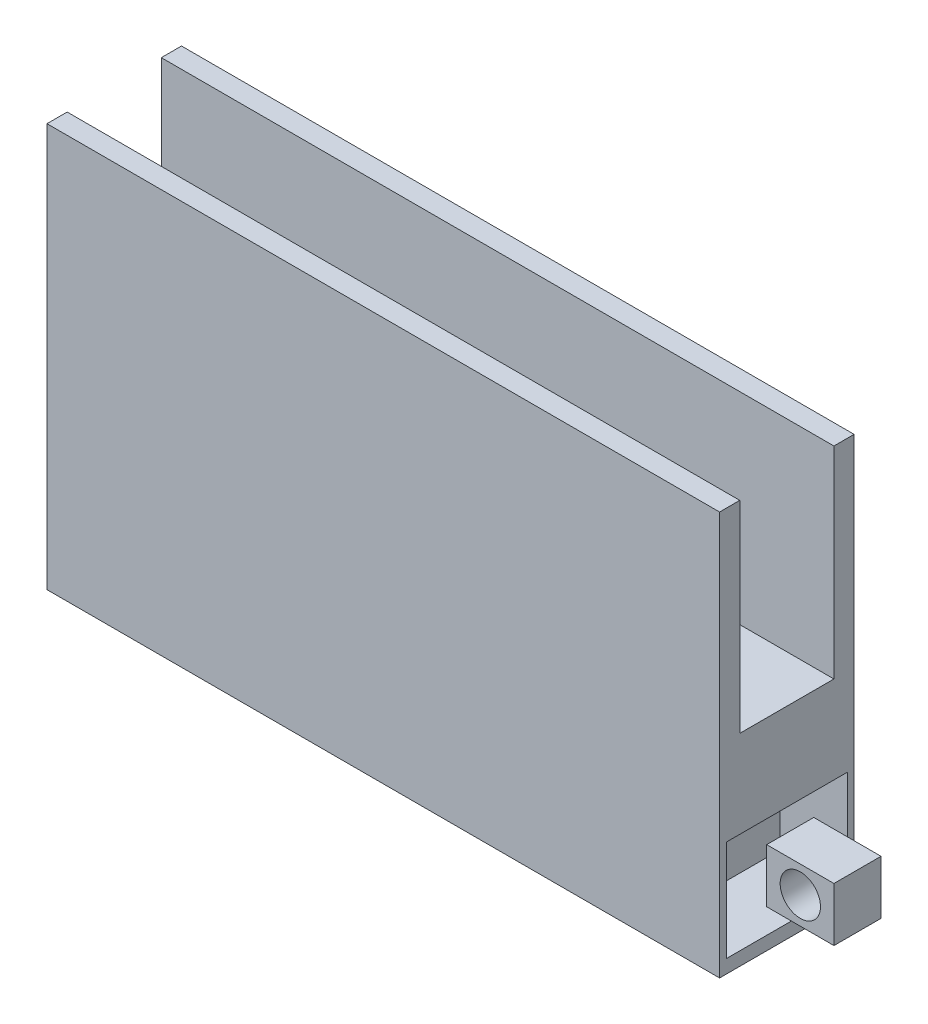
ISO-10303-21;
HEADER;
FILE_DESCRIPTION(('STEP AP214'),'2;1');
FILE_NAME('part.step','',(''),(''),'','','');
FILE_SCHEMA(('AUTOMOTIVE_DESIGN { 1 0 10303 214 1 1 1 1 }'));
ENDSEC;
DATA;
#1=APPLICATION_CONTEXT('core data for automotive mechanical design processes');
#2=APPLICATION_PROTOCOL_DEFINITION('international standard','automotive_design',2000,#1);
#3=PRODUCT_CONTEXT('',#1,'mechanical');
#4=PRODUCT('Part','Part','',(#3));
#5=PRODUCT_RELATED_PRODUCT_CATEGORY('part','',(#4));
#6=PRODUCT_DEFINITION_FORMATION('','',#4);
#7=PRODUCT_DEFINITION_CONTEXT('part definition',#1,'design');
#8=PRODUCT_DEFINITION('design','',#6,#7);
#9=PRODUCT_DEFINITION_SHAPE('','',#8);
#10=(LENGTH_UNIT() NAMED_UNIT(*) SI_UNIT(.MILLI.,.METRE.));
#11=(NAMED_UNIT(*) PLANE_ANGLE_UNIT() SI_UNIT($,.RADIAN.));
#12=(NAMED_UNIT(*) SI_UNIT($,.STERADIAN.) SOLID_ANGLE_UNIT());
#13=UNCERTAINTY_MEASURE_WITH_UNIT(LENGTH_MEASURE(1.E-05),#10,'distance_accuracy_value','');
#14=(GEOMETRIC_REPRESENTATION_CONTEXT(3) GLOBAL_UNCERTAINTY_ASSIGNED_CONTEXT((#13)) GLOBAL_UNIT_ASSIGNED_CONTEXT((#10,
#11,#12)) REPRESENTATION_CONTEXT('',''));
#15=CARTESIAN_POINT('',(0.,0.,0.));
#16=DIRECTION('',(0.,0.,1.));
#17=DIRECTION('',(1.,0.,0.));
#18=AXIS2_PLACEMENT_3D('',#15,#16,#17);
#19=CARTESIAN_POINT('',(4.,0.239962180573495,0.3));
#20=DIRECTION('',(0.,-1.,0.));
#21=DIRECTION('',(0.,0.,-1.));
#22=AXIS2_PLACEMENT_3D('',#19,#20,#21);
#23=PLANE('',#22);
#24=DIRECTION('',(-1.,0.,0.));
#25=VECTOR('',#24,1.);
#26=CARTESIAN_POINT('',(4.,0.239962180573495,0.3));
#27=LINE('',#26,#25);
#28=CARTESIAN_POINT('',(4.,0.239962180573495,0.3));
#29=VERTEX_POINT('',#28);
#30=CARTESIAN_POINT('',(3.24,0.239962180573494,0.3));
#31=VERTEX_POINT('',#30);
#32=EDGE_CURVE('E240',#29,#31,#27,.T.);
#33=ORIENTED_EDGE('',*,*,#32,.T.);
#34=DIRECTION('',(0.,0.,1.));
#35=VECTOR('',#34,1.);
#36=CARTESIAN_POINT('',(3.24,0.239962180573495,0.3));
#37=LINE('',#36,#35);
#38=CARTESIAN_POINT('',(3.24,0.239962180573494,1.7));
#39=VERTEX_POINT('',#38);
#40=EDGE_CURVE('E12',#31,#39,#37,.T.);
#41=ORIENTED_EDGE('',*,*,#40,.T.);
#42=DIRECTION('',(-1.,0.,0.));
#43=VECTOR('',#42,1.);
#44=CARTESIAN_POINT('',(4.,0.239962180573495,1.7));
#45=LINE('',#44,#43);
#46=CARTESIAN_POINT('',(4.,0.239962180573495,1.7));
#47=VERTEX_POINT('',#46);
#48=EDGE_CURVE('E184',#47,#39,#45,.T.);
#49=ORIENTED_EDGE('',*,*,#48,.F.);
#50=DIRECTION('',(0.,0.,1.));
#51=VECTOR('',#50,1.);
#52=CARTESIAN_POINT('',(4.,0.239962180573495,0.3));
#53=LINE('',#52,#51);
#54=EDGE_CURVE('E213',#29,#47,#53,.T.);
#55=ORIENTED_EDGE('',*,*,#54,.F.);
#56=EDGE_LOOP('',(#33,#41,#49,#55));
#57=FACE_BOUND('',#56,.T.);
#58=ADVANCED_FACE('F43',(#57),#23,.F.);
#59=CARTESIAN_POINT('',(0.,6.,0.));
#60=DIRECTION('',(0.,1.,0.));
#61=DIRECTION('',(0.,0.,1.));
#62=AXIS2_PLACEMENT_3D('',#59,#60,#61);
#63=PLANE('',#62);
#64=DIRECTION('',(-1.,0.,0.));
#65=VECTOR('',#64,1.);
#66=CARTESIAN_POINT('',(0.,6.,0.3));
#67=LINE('',#66,#65);
#68=CARTESIAN_POINT('',(10.,6.,0.3));
#69=VERTEX_POINT('',#68);
#70=CARTESIAN_POINT('',(0.,6.,0.3));
#71=VERTEX_POINT('',#70);
#72=EDGE_CURVE('E247',#69,#71,#67,.T.);
#73=ORIENTED_EDGE('',*,*,#72,.F.);
#74=DIRECTION('',(0.,0.,-1.));
#75=VECTOR('',#74,1.);
#76=CARTESIAN_POINT('',(10.,6.,0.));
#77=LINE('',#76,#75);
#78=CARTESIAN_POINT('',(10.,6.,0.));
#79=VERTEX_POINT('',#78);
#80=EDGE_CURVE('E296',#69,#79,#77,.T.);
#81=ORIENTED_EDGE('',*,*,#80,.T.);
#82=DIRECTION('',(-1.,0.,0.));
#83=VECTOR('',#82,1.);
#84=CARTESIAN_POINT('',(0.,6.,0.));
#85=LINE('',#84,#83);
#86=CARTESIAN_POINT('',(0.,6.,0.));
#87=VERTEX_POINT('',#86);
#88=EDGE_CURVE('E289',#79,#87,#85,.T.);
#89=ORIENTED_EDGE('',*,*,#88,.T.);
#90=DIRECTION('',(0.,0.,1.));
#91=VECTOR('',#90,1.);
#92=CARTESIAN_POINT('',(0.,6.,0.));
#93=LINE('',#92,#91);
#94=EDGE_CURVE('E300',#87,#71,#93,.T.);
#95=ORIENTED_EDGE('',*,*,#94,.T.);
#96=EDGE_LOOP('',(#73,#81,#89,#95));
#97=FACE_BOUND('',#96,.T.);
#98=ADVANCED_FACE('F366',(#97),#63,.T.);
#99=CARTESIAN_POINT('',(10.,0.,2.));
#100=DIRECTION('',(-1.,0.,0.));
#101=DIRECTION('',(0.,0.,1.));
#102=AXIS2_PLACEMENT_3D('',#99,#100,#101);
#103=PLANE('',#102);
#104=ORIENTED_EDGE('',*,*,#80,.F.);
#105=DIRECTION('',(0.,1.,0.));
#106=VECTOR('',#105,1.);
#107=CARTESIAN_POINT('',(10.,3.,0.3));
#108=LINE('',#107,#106);
#109=CARTESIAN_POINT('',(10.,3.,0.3));
#110=VERTEX_POINT('',#109);
#111=EDGE_CURVE('E262',#110,#69,#108,.T.);
#112=ORIENTED_EDGE('',*,*,#111,.F.);
#113=DIRECTION('',(0.,0.,-1.));
#114=VECTOR('',#113,1.);
#115=CARTESIAN_POINT('',(10.,3.,0.3));
#116=LINE('',#115,#114);
#117=CARTESIAN_POINT('',(10.,3.,1.7));
#118=VERTEX_POINT('',#117);
#119=EDGE_CURVE('E250',#118,#110,#116,.T.);
#120=ORIENTED_EDGE('',*,*,#119,.F.);
#121=DIRECTION('',(0.,1.,0.));
#122=VECTOR('',#121,1.);
#123=CARTESIAN_POINT('',(10.,3.,1.7));
#124=LINE('',#123,#122);
#125=CARTESIAN_POINT('',(10.,6.,1.7));
#126=VERTEX_POINT('',#125);
#127=EDGE_CURVE('E264',#118,#126,#124,.T.);
#128=ORIENTED_EDGE('',*,*,#127,.T.);
#129=CARTESIAN_POINT('',(10.,6.,2.));
#130=VERTEX_POINT('',#129);
#131=EDGE_CURVE('E293',#130,#126,#77,.T.);
#132=ORIENTED_EDGE('',*,*,#131,.F.);
#133=DIRECTION('',(0.,1.,0.));
#134=VECTOR('',#133,1.);
#135=CARTESIAN_POINT('',(10.,0.,2.));
#136=LINE('',#135,#134);
#137=CARTESIAN_POINT('',(10.,0.,2.));
#138=VERTEX_POINT('',#137);
#139=EDGE_CURVE('E282',#138,#130,#136,.T.);
#140=ORIENTED_EDGE('',*,*,#139,.F.);
#141=DIRECTION('',(0.,0.,-1.));
#142=VECTOR('',#141,1.);
#143=CARTESIAN_POINT('',(10.,0.,2.));
#144=LINE('',#143,#142);
#145=CARTESIAN_POINT('',(10.,0.,0.));
#146=VERTEX_POINT('',#145);
#147=EDGE_CURVE('E273',#138,#146,#144,.T.);
#148=ORIENTED_EDGE('',*,*,#147,.T.);
#149=DIRECTION('',(0.,1.,0.));
#150=VECTOR('',#149,1.);
#151=CARTESIAN_POINT('',(10.,0.,0.));
#152=LINE('',#151,#150);
#153=EDGE_CURVE('E261',#146,#79,#152,.T.);
#154=ORIENTED_EDGE('',*,*,#153,.T.);
#155=EDGE_LOOP('',(#104,#112,#120,#128,#132,#140,#148,#154));
#156=FACE_BOUND('',#155,.T.);
#157=DIRECTION('',(0.,0.,-1.));
#158=VECTOR('',#157,1.);
#159=CARTESIAN_POINT('',(10.,0.2,1.9));
#160=LINE('',#159,#158);
#161=CARTESIAN_POINT('',(10.,0.2,1.9));
#162=VERTEX_POINT('',#161);
#163=CARTESIAN_POINT('',(10.,0.2,0.0999999999999998));
#164=VERTEX_POINT('',#163);
#165=EDGE_CURVE('E307',#162,#164,#160,.T.);
#166=ORIENTED_EDGE('',*,*,#165,.F.);
#167=DIRECTION('',(0.,-1.,0.));
#168=VECTOR('',#167,1.);
#169=CARTESIAN_POINT('',(10.,1.7,1.9));
#170=LINE('',#169,#168);
#171=CARTESIAN_POINT('',(10.,1.7,1.9));
#172=VERTEX_POINT('',#171);
#173=EDGE_CURVE('E292',#172,#162,#170,.T.);
#174=ORIENTED_EDGE('',*,*,#173,.F.);
#175=DIRECTION('',(0.,0.,1.));
#176=VECTOR('',#175,1.);
#177=CARTESIAN_POINT('',(10.,1.7,1.9));
#178=LINE('',#177,#176);
#179=CARTESIAN_POINT('',(10.,1.7,0.1));
#180=VERTEX_POINT('',#179);
#181=EDGE_CURVE('E313',#180,#172,#178,.T.);
#182=ORIENTED_EDGE('',*,*,#181,.F.);
#183=DIRECTION('',(0.,1.,0.));
#184=VECTOR('',#183,1.);
#185=CARTESIAN_POINT('',(10.,1.7,0.1));
#186=LINE('',#185,#184);
#187=EDGE_CURVE('E310',#164,#180,#186,.T.);
#188=ORIENTED_EDGE('',*,*,#187,.F.);
#189=EDGE_LOOP('',(#166,#174,#182,#188));
#190=FACE_BOUND('',#189,.T.);
#191=ADVANCED_FACE('F371',(#156,#190),#103,.F.);
#192=CARTESIAN_POINT('',(0.,2.,2.));
#193=DIRECTION('',(1.,0.,0.));
#194=DIRECTION('',(0.,0.,-1.));
#195=AXIS2_PLACEMENT_3D('',#192,#193,#194);
#196=PLANE('',#195);
#197=DIRECTION('',(0.,0.,1.));
#198=VECTOR('',#197,1.);
#199=CARTESIAN_POINT('',(0.,0.239962180573495,0.3));
#200=LINE('',#199,#198);
#201=CARTESIAN_POINT('',(0.,0.239962180573495,0.3));
#202=VERTEX_POINT('',#201);
#203=CARTESIAN_POINT('',(0.,0.239962180573495,1.7));
#204=VERTEX_POINT('',#203);
#205=EDGE_CURVE('E226',#202,#204,#200,.T.);
#206=ORIENTED_EDGE('',*,*,#205,.F.);
#207=DIRECTION('',(0.,-1.,0.));
#208=VECTOR('',#207,1.);
#209=CARTESIAN_POINT('',(0.,0.239962180573495,0.3));
#210=LINE('',#209,#208);
#211=CARTESIAN_POINT('',(0.,1.63996218057349,0.3));
#212=VERTEX_POINT('',#211);
#213=EDGE_CURVE('E209',#212,#202,#210,.T.);
#214=ORIENTED_EDGE('',*,*,#213,.F.);
#215=DIRECTION('',(0.,0.,-1.));
#216=VECTOR('',#215,1.);
#217=CARTESIAN_POINT('',(0.,1.63996218057349,0.3));
#218=LINE('',#217,#216);
#219=CARTESIAN_POINT('',(0.,1.63996218057349,1.7));
#220=VERTEX_POINT('',#219);
#221=EDGE_CURVE('E214',#220,#212,#218,.T.);
#222=ORIENTED_EDGE('',*,*,#221,.F.);
#223=DIRECTION('',(0.,1.,0.));
#224=VECTOR('',#223,1.);
#225=CARTESIAN_POINT('',(0.,0.239962180573495,1.7));
#226=LINE('',#225,#224);
#227=EDGE_CURVE('E229',#204,#220,#226,.T.);
#228=ORIENTED_EDGE('',*,*,#227,.F.);
#229=EDGE_LOOP('',(#206,#214,#222,#228));
#230=FACE_BOUND('',#229,.T.);
#231=DIRECTION('',(0.,0.,1.));
#232=VECTOR('',#231,1.);
#233=CARTESIAN_POINT('',(0.,3.,0.3));
#234=LINE('',#233,#232);
#235=CARTESIAN_POINT('',(0.,3.,0.3));
#236=VERTEX_POINT('',#235);
#237=CARTESIAN_POINT('',(0.,3.,1.7));
#238=VERTEX_POINT('',#237);
#239=EDGE_CURVE('E243',#236,#238,#234,.T.);
#240=ORIENTED_EDGE('',*,*,#239,.F.);
#241=DIRECTION('',(0.,1.,0.));
#242=VECTOR('',#241,1.);
#243=CARTESIAN_POINT('',(0.,3.,0.3));
#244=LINE('',#243,#242);
#245=EDGE_CURVE('E258',#236,#71,#244,.T.);
#246=ORIENTED_EDGE('',*,*,#245,.T.);
#247=ORIENTED_EDGE('',*,*,#94,.F.);
#248=DIRECTION('',(0.,-1.,0.));
#249=VECTOR('',#248,1.);
#250=CARTESIAN_POINT('',(0.,2.,0.));
#251=LINE('',#250,#249);
#252=CARTESIAN_POINT('',(0.,0.,0.));
#253=VERTEX_POINT('',#252);
#254=EDGE_CURVE('E276',#87,#253,#251,.T.);
#255=ORIENTED_EDGE('',*,*,#254,.T.);
#256=DIRECTION('',(0.,0.,-1.));
#257=VECTOR('',#256,1.);
#258=CARTESIAN_POINT('',(0.,0.,2.));
#259=LINE('',#258,#257);
#260=CARTESIAN_POINT('',(0.,0.,2.));
#261=VERTEX_POINT('',#260);
#262=EDGE_CURVE('E268',#261,#253,#259,.T.);
#263=ORIENTED_EDGE('',*,*,#262,.F.);
#264=DIRECTION('',(0.,-1.,0.));
#265=VECTOR('',#264,1.);
#266=CARTESIAN_POINT('',(0.,2.,2.));
#267=LINE('',#266,#265);
#268=CARTESIAN_POINT('',(0.,6.,2.));
#269=VERTEX_POINT('',#268);
#270=EDGE_CURVE('E271',#269,#261,#267,.T.);
#271=ORIENTED_EDGE('',*,*,#270,.F.);
#272=CARTESIAN_POINT('',(0.,6.,1.7));
#273=VERTEX_POINT('',#272);
#274=EDGE_CURVE('E284',#273,#269,#93,.T.);
#275=ORIENTED_EDGE('',*,*,#274,.F.);
#276=DIRECTION('',(0.,1.,0.));
#277=VECTOR('',#276,1.);
#278=CARTESIAN_POINT('',(0.,3.,1.7));
#279=LINE('',#278,#277);
#280=EDGE_CURVE('E255',#238,#273,#279,.T.);
#281=ORIENTED_EDGE('',*,*,#280,.F.);
#282=EDGE_LOOP('',(#240,#246,#247,#255,#263,#271,#275,#281));
#283=FACE_BOUND('',#282,.T.);
#284=ADVANCED_FACE('F345',(#230,#283),#196,.F.);
#285=CARTESIAN_POINT('',(0.,0.,2.));
#286=DIRECTION('',(0.,1.,0.));
#287=DIRECTION('',(0.,0.,1.));
#288=AXIS2_PLACEMENT_3D('',#285,#286,#287);
#289=PLANE('',#288);
#290=DIRECTION('',(0.,0.,1.));
#291=VECTOR('',#290,1.);
#292=CARTESIAN_POINT('',(3.24,0.,1.7));
#293=LINE('',#292,#291);
#294=CARTESIAN_POINT('',(3.24,0.,0.3));
#295=VERTEX_POINT('',#294);
#296=CARTESIAN_POINT('',(3.24,0.,1.7));
#297=VERTEX_POINT('',#296);
#298=EDGE_CURVE('E190',#295,#297,#293,.T.);
#299=ORIENTED_EDGE('',*,*,#298,.F.);
#300=DIRECTION('',(1.,0.,0.));
#301=VECTOR('',#300,1.);
#302=CARTESIAN_POINT('',(0.24,0.,0.3));
#303=LINE('',#302,#301);
#304=CARTESIAN_POINT('',(0.24,0.,0.3));
#305=VERTEX_POINT('',#304);
#306=EDGE_CURVE('E196',#305,#295,#303,.T.);
#307=ORIENTED_EDGE('',*,*,#306,.F.);
#308=DIRECTION('',(0.,0.,-1.));
#309=VECTOR('',#308,1.);
#310=CARTESIAN_POINT('',(0.24,0.,1.7));
#311=LINE('',#310,#309);
#312=CARTESIAN_POINT('',(0.24,0.,1.7));
#313=VERTEX_POINT('',#312);
#314=EDGE_CURVE('E201',#313,#305,#311,.T.);
#315=ORIENTED_EDGE('',*,*,#314,.F.);
#316=DIRECTION('',(-1.,0.,0.));
#317=VECTOR('',#316,1.);
#318=CARTESIAN_POINT('',(0.24,0.,1.7));
#319=LINE('',#318,#317);
#320=EDGE_CURVE('E58',#297,#313,#319,.T.);
#321=ORIENTED_EDGE('',*,*,#320,.F.);
#322=EDGE_LOOP('',(#299,#307,#315,#321));
#323=FACE_BOUND('',#322,.T.);
#324=DIRECTION('',(1.,0.,0.));
#325=VECTOR('',#324,1.);
#326=CARTESIAN_POINT('',(0.,0.,0.));
#327=LINE('',#326,#325);
#328=EDGE_CURVE('E272',#253,#146,#327,.T.);
#329=ORIENTED_EDGE('',*,*,#328,.T.);
#330=ORIENTED_EDGE('',*,*,#147,.F.);
#331=DIRECTION('',(1.,0.,0.));
#332=VECTOR('',#331,1.);
#333=CARTESIAN_POINT('',(0.,0.,2.));
#334=LINE('',#333,#332);
#335=EDGE_CURVE('E285',#261,#138,#334,.T.);
#336=ORIENTED_EDGE('',*,*,#335,.F.);
#337=ORIENTED_EDGE('',*,*,#262,.T.);
#338=EDGE_LOOP('',(#329,#330,#336,#337));
#339=FACE_BOUND('',#338,.T.);
#340=ADVANCED_FACE('F199',(#323,#339),#289,.F.);
#341=CARTESIAN_POINT('',(0.,0.,2.));
#342=DIRECTION('',(0.,0.,1.));
#343=DIRECTION('',(1.,0.,0.));
#344=AXIS2_PLACEMENT_3D('',#341,#342,#343);
#345=PLANE('',#344);
#346=ORIENTED_EDGE('',*,*,#270,.T.);
#347=ORIENTED_EDGE('',*,*,#335,.T.);
#348=ORIENTED_EDGE('',*,*,#139,.T.);
#349=DIRECTION('',(1.,0.,0.));
#350=VECTOR('',#349,1.);
#351=CARTESIAN_POINT('',(0.,6.,2.));
#352=LINE('',#351,#350);
#353=EDGE_CURVE('E297',#269,#130,#352,.T.);
#354=ORIENTED_EDGE('',*,*,#353,.F.);
#355=EDGE_LOOP('',(#346,#347,#348,#354));
#356=FACE_BOUND('',#355,.T.);
#357=ADVANCED_FACE('F424',(#356),#345,.T.);
#358=CARTESIAN_POINT('',(0.,0.,0.));
#359=DIRECTION('',(0.,0.,1.));
#360=DIRECTION('',(1.,0.,0.));
#361=AXIS2_PLACEMENT_3D('',#358,#359,#360);
#362=PLANE('',#361);
#363=ORIENTED_EDGE('',*,*,#254,.F.);
#364=ORIENTED_EDGE('',*,*,#88,.F.);
#365=ORIENTED_EDGE('',*,*,#153,.F.);
#366=ORIENTED_EDGE('',*,*,#328,.F.);
#367=EDGE_LOOP('',(#363,#364,#365,#366));
#368=FACE_BOUND('',#367,.T.);
#369=ADVANCED_FACE('F484',(#368),#362,.F.);
#370=DIRECTION('',(1.,0.,0.));
#371=VECTOR('',#370,1.);
#372=CARTESIAN_POINT('',(0.,6.,1.7));
#373=LINE('',#372,#371);
#374=EDGE_CURVE('E235',#273,#126,#373,.T.);
#375=ORIENTED_EDGE('',*,*,#374,.F.);
#376=ORIENTED_EDGE('',*,*,#274,.T.);
#377=ORIENTED_EDGE('',*,*,#353,.T.);
#378=ORIENTED_EDGE('',*,*,#131,.T.);
#379=EDGE_LOOP('',(#375,#376,#377,#378));
#380=FACE_BOUND('',#379,.T.);
#381=ADVANCED_FACE('F374',(#380),#63,.T.);
#382=CARTESIAN_POINT('',(9.,1.7,1.9));
#383=DIRECTION('',(0.,0.,1.));
#384=DIRECTION('',(0.,-1.,0.));
#385=AXIS2_PLACEMENT_3D('',#382,#383,#384);
#386=PLANE('',#385);
#387=ORIENTED_EDGE('',*,*,#173,.T.);
#388=DIRECTION('',(1.,0.,0.));
#389=VECTOR('',#388,1.);
#390=CARTESIAN_POINT('',(9.,0.2,1.9));
#391=LINE('',#390,#389);
#392=CARTESIAN_POINT('',(9.,0.2,1.9));
#393=VERTEX_POINT('',#392);
#394=EDGE_CURVE('E303',#393,#162,#391,.T.);
#395=ORIENTED_EDGE('',*,*,#394,.F.);
#396=DIRECTION('',(0.,-1.,0.));
#397=VECTOR('',#396,1.);
#398=CARTESIAN_POINT('',(9.,1.7,1.9));
#399=LINE('',#398,#397);
#400=CARTESIAN_POINT('',(9.,1.7,1.9));
#401=VERTEX_POINT('',#400);
#402=EDGE_CURVE('E306',#401,#393,#399,.T.);
#403=ORIENTED_EDGE('',*,*,#402,.F.);
#404=DIRECTION('',(1.,0.,0.));
#405=VECTOR('',#404,1.);
#406=CARTESIAN_POINT('',(9.,1.7,1.9));
#407=LINE('',#406,#405);
#408=EDGE_CURVE('E314',#401,#172,#407,.T.);
#409=ORIENTED_EDGE('',*,*,#408,.T.);
#410=EDGE_LOOP('',(#387,#395,#403,#409));
#411=FACE_BOUND('',#410,.T.);
#412=ADVANCED_FACE('F483',(#411),#386,.F.);
#413=CARTESIAN_POINT('',(9.,1.7,1.9));
#414=DIRECTION('',(0.,1.,0.));
#415=DIRECTION('',(0.,0.,1.));
#416=AXIS2_PLACEMENT_3D('',#413,#414,#415);
#417=PLANE('',#416);
#418=ORIENTED_EDGE('',*,*,#181,.T.);
#419=ORIENTED_EDGE('',*,*,#408,.F.);
#420=DIRECTION('',(0.,0.,1.));
#421=VECTOR('',#420,1.);
#422=CARTESIAN_POINT('',(9.,1.7,1.9));
#423=LINE('',#422,#421);
#424=CARTESIAN_POINT('',(9.,1.7,0.1));
#425=VERTEX_POINT('',#424);
#426=EDGE_CURVE('E323',#425,#401,#423,.T.);
#427=ORIENTED_EDGE('',*,*,#426,.F.);
#428=DIRECTION('',(1.,0.,0.));
#429=VECTOR('',#428,1.);
#430=CARTESIAN_POINT('',(9.,1.7,0.1));
#431=LINE('',#430,#429);
#432=EDGE_CURVE('E311',#425,#180,#431,.T.);
#433=ORIENTED_EDGE('',*,*,#432,.T.);
#434=EDGE_LOOP('',(#418,#419,#427,#433));
#435=FACE_BOUND('',#434,.T.);
#436=ADVANCED_FACE('F528',(#435),#417,.F.);
#437=CARTESIAN_POINT('',(9.,1.7,0.1));
#438=DIRECTION('',(0.,0.,-1.));
#439=DIRECTION('',(0.,1.,0.));
#440=AXIS2_PLACEMENT_3D('',#437,#438,#439);
#441=PLANE('',#440);
#442=ORIENTED_EDGE('',*,*,#187,.T.);
#443=ORIENTED_EDGE('',*,*,#432,.F.);
#444=DIRECTION('',(0.,1.,0.));
#445=VECTOR('',#444,1.);
#446=CARTESIAN_POINT('',(9.,1.7,0.1));
#447=LINE('',#446,#445);
#448=CARTESIAN_POINT('',(9.,0.2,0.0999999999999998));
#449=VERTEX_POINT('',#448);
#450=EDGE_CURVE('E326',#449,#425,#447,.T.);
#451=ORIENTED_EDGE('',*,*,#450,.F.);
#452=DIRECTION('',(1.,0.,0.));
#453=VECTOR('',#452,1.);
#454=CARTESIAN_POINT('',(9.,0.2,0.0999999999999998));
#455=LINE('',#454,#453);
#456=EDGE_CURVE('E308',#449,#164,#455,.T.);
#457=ORIENTED_EDGE('',*,*,#456,.T.);
#458=EDGE_LOOP('',(#442,#443,#451,#457));
#459=FACE_BOUND('',#458,.T.);
#460=ADVANCED_FACE('F518',(#459),#441,.F.);
#461=CARTESIAN_POINT('',(9.,0.2,1.9));
#462=DIRECTION('',(0.,-1.,0.));
#463=DIRECTION('',(0.,0.,-1.));
#464=AXIS2_PLACEMENT_3D('',#461,#462,#463);
#465=PLANE('',#464);
#466=ORIENTED_EDGE('',*,*,#165,.T.);
#467=ORIENTED_EDGE('',*,*,#456,.F.);
#468=DIRECTION('',(0.,0.,-1.));
#469=VECTOR('',#468,1.);
#470=CARTESIAN_POINT('',(9.,0.2,1.9));
#471=LINE('',#470,#469);
#472=EDGE_CURVE('E329',#393,#449,#471,.T.);
#473=ORIENTED_EDGE('',*,*,#472,.F.);
#474=ORIENTED_EDGE('',*,*,#394,.T.);
#475=EDGE_LOOP('',(#466,#467,#473,#474));
#476=FACE_BOUND('',#475,.T.);
#477=ADVANCED_FACE('F509',(#476),#465,.F.);
#478=CARTESIAN_POINT('',(9.,0.,0.));
#479=DIRECTION('',(1.,0.,0.));
#480=DIRECTION('',(0.,0.,-1.));
#481=AXIS2_PLACEMENT_3D('',#478,#479,#480);
#482=PLANE('',#481);
#483=ORIENTED_EDGE('',*,*,#402,.T.);
#484=ORIENTED_EDGE('',*,*,#472,.T.);
#485=ORIENTED_EDGE('',*,*,#450,.T.);
#486=ORIENTED_EDGE('',*,*,#426,.T.);
#487=EDGE_LOOP('',(#483,#484,#485,#486));
#488=FACE_BOUND('',#487,.T.);
#489=ADVANCED_FACE('F45',(#488),#482,.T.);
#490=CARTESIAN_POINT('',(0.,3.,0.3));
#491=DIRECTION('',(0.,0.,-1.));
#492=DIRECTION('',(-1.,0.,0.));
#493=AXIS2_PLACEMENT_3D('',#490,#491,#492);
#494=PLANE('',#493);
#495=ORIENTED_EDGE('',*,*,#72,.T.);
#496=ORIENTED_EDGE('',*,*,#245,.F.);
#497=DIRECTION('',(-1.,0.,0.));
#498=VECTOR('',#497,1.);
#499=CARTESIAN_POINT('',(0.,3.,0.3));
#500=LINE('',#499,#498);
#501=EDGE_CURVE('E252',#110,#236,#500,.T.);
#502=ORIENTED_EDGE('',*,*,#501,.F.);
#503=ORIENTED_EDGE('',*,*,#111,.T.);
#504=EDGE_LOOP('',(#495,#496,#502,#503));
#505=FACE_BOUND('',#504,.T.);
#506=ADVANCED_FACE('F462',(#505),#494,.F.);
#507=CARTESIAN_POINT('',(0.,3.,1.7));
#508=DIRECTION('',(0.,0.,1.));
#509=DIRECTION('',(1.,0.,0.));
#510=AXIS2_PLACEMENT_3D('',#507,#508,#509);
#511=PLANE('',#510);
#512=ORIENTED_EDGE('',*,*,#374,.T.);
#513=ORIENTED_EDGE('',*,*,#127,.F.);
#514=DIRECTION('',(1.,0.,0.));
#515=VECTOR('',#514,1.);
#516=CARTESIAN_POINT('',(0.,3.,1.7));
#517=LINE('',#516,#515);
#518=EDGE_CURVE('E246',#238,#118,#517,.T.);
#519=ORIENTED_EDGE('',*,*,#518,.F.);
#520=ORIENTED_EDGE('',*,*,#280,.T.);
#521=EDGE_LOOP('',(#512,#513,#519,#520));
#522=FACE_BOUND('',#521,.T.);
#523=ADVANCED_FACE('F452',(#522),#511,.F.);
#524=CARTESIAN_POINT('',(0.,3.,0.));
#525=DIRECTION('',(0.,1.,0.));
#526=DIRECTION('',(0.,0.,1.));
#527=AXIS2_PLACEMENT_3D('',#524,#525,#526);
#528=PLANE('',#527);
#529=ORIENTED_EDGE('',*,*,#239,.T.);
#530=ORIENTED_EDGE('',*,*,#518,.T.);
#531=ORIENTED_EDGE('',*,*,#119,.T.);
#532=ORIENTED_EDGE('',*,*,#501,.T.);
#533=EDGE_LOOP('',(#529,#530,#531,#532));
#534=FACE_BOUND('',#533,.T.);
#535=ADVANCED_FACE('F362',(#534),#528,.T.);
#536=CARTESIAN_POINT('',(4.,0.239962180573495,0.3));
#537=DIRECTION('',(0.,0.,-1.));
#538=DIRECTION('',(-1.,0.,0.));
#539=AXIS2_PLACEMENT_3D('',#536,#537,#538);
#540=PLANE('',#539);
#541=CARTESIAN_POINT('',(0.24,0.239962180573495,0.3));
#542=VERTEX_POINT('',#541);
#543=EDGE_CURVE('E223',#542,#202,#27,.T.);
#544=ORIENTED_EDGE('',*,*,#543,.F.);
#545=DIRECTION('',(0.,-1.,0.));
#546=VECTOR('',#545,1.);
#547=CARTESIAN_POINT('',(0.24,4.95055125202286,0.3));
#548=LINE('',#547,#546);
#549=EDGE_CURVE('E66',#542,#305,#548,.T.);
#550=ORIENTED_EDGE('',*,*,#549,.T.);
#551=ORIENTED_EDGE('',*,*,#306,.T.);
#552=DIRECTION('',(0.,-1.,0.));
#553=VECTOR('',#552,1.);
#554=CARTESIAN_POINT('',(3.24,4.95055125202286,0.3));
#555=LINE('',#554,#553);
#556=EDGE_CURVE('E187',#31,#295,#555,.T.);
#557=ORIENTED_EDGE('',*,*,#556,.F.);
#558=ORIENTED_EDGE('',*,*,#32,.F.);
#559=DIRECTION('',(0.,-1.,0.));
#560=VECTOR('',#559,1.);
#561=CARTESIAN_POINT('',(4.,0.239962180573495,0.3));
#562=LINE('',#561,#560);
#563=CARTESIAN_POINT('',(4.,1.63996218057349,0.3));
#564=VERTEX_POINT('',#563);
#565=EDGE_CURVE('E210',#564,#29,#562,.T.);
#566=ORIENTED_EDGE('',*,*,#565,.F.);
#567=DIRECTION('',(-1.,0.,0.));
#568=VECTOR('',#567,1.);
#569=CARTESIAN_POINT('',(4.,1.63996218057349,0.3));
#570=LINE('',#569,#568);
#571=EDGE_CURVE('E233',#564,#212,#570,.T.);
#572=ORIENTED_EDGE('',*,*,#571,.T.);
#573=ORIENTED_EDGE('',*,*,#213,.T.);
#574=EDGE_LOOP('',(#544,#550,#551,#557,#558,#566,#572,#573));
#575=FACE_BOUND('',#574,.T.);
#576=ADVANCED_FACE('F338',(#575),#540,.F.);
#577=CARTESIAN_POINT('',(4.,1.63996218057349,0.3));
#578=DIRECTION('',(0.,1.,0.));
#579=DIRECTION('',(0.,0.,1.));
#580=AXIS2_PLACEMENT_3D('',#577,#578,#579);
#581=PLANE('',#580);
#582=ORIENTED_EDGE('',*,*,#221,.T.);
#583=ORIENTED_EDGE('',*,*,#571,.F.);
#584=DIRECTION('',(0.,0.,-1.));
#585=VECTOR('',#584,1.);
#586=CARTESIAN_POINT('',(4.,1.63996218057349,0.3));
#587=LINE('',#586,#585);
#588=CARTESIAN_POINT('',(4.,1.63996218057349,1.7));
#589=VERTEX_POINT('',#588);
#590=EDGE_CURVE('E220',#589,#564,#587,.T.);
#591=ORIENTED_EDGE('',*,*,#590,.F.);
#592=DIRECTION('',(-1.,0.,0.));
#593=VECTOR('',#592,1.);
#594=CARTESIAN_POINT('',(4.,1.63996218057349,1.7));
#595=LINE('',#594,#593);
#596=EDGE_CURVE('E236',#589,#220,#595,.T.);
#597=ORIENTED_EDGE('',*,*,#596,.T.);
#598=EDGE_LOOP('',(#582,#583,#591,#597));
#599=FACE_BOUND('',#598,.T.);
#600=ADVANCED_FACE('F354',(#599),#581,.F.);
#601=CARTESIAN_POINT('',(4.,0.239962180573495,1.7));
#602=DIRECTION('',(0.,0.,1.));
#603=DIRECTION('',(1.,0.,0.));
#604=AXIS2_PLACEMENT_3D('',#601,#602,#603);
#605=PLANE('',#604);
#606=ORIENTED_EDGE('',*,*,#227,.T.);
#607=ORIENTED_EDGE('',*,*,#596,.F.);
#608=DIRECTION('',(0.,1.,0.));
#609=VECTOR('',#608,1.);
#610=CARTESIAN_POINT('',(4.,0.239962180573495,1.7));
#611=LINE('',#610,#609);
#612=EDGE_CURVE('E217',#47,#589,#611,.T.);
#613=ORIENTED_EDGE('',*,*,#612,.F.);
#614=ORIENTED_EDGE('',*,*,#48,.T.);
#615=DIRECTION('',(0.,-1.,0.));
#616=VECTOR('',#615,1.);
#617=CARTESIAN_POINT('',(3.24,4.95055125202286,1.7));
#618=LINE('',#617,#616);
#619=EDGE_CURVE('E179',#39,#297,#618,.T.);
#620=ORIENTED_EDGE('',*,*,#619,.T.);
#621=ORIENTED_EDGE('',*,*,#320,.T.);
#622=DIRECTION('',(0.,-1.,0.));
#623=VECTOR('',#622,1.);
#624=CARTESIAN_POINT('',(0.24,4.95055125202286,1.7));
#625=LINE('',#624,#623);
#626=CARTESIAN_POINT('',(0.24,0.239962180573494,1.7));
#627=VERTEX_POINT('',#626);
#628=EDGE_CURVE('E186',#627,#313,#625,.T.);
#629=ORIENTED_EDGE('',*,*,#628,.F.);
#630=EDGE_CURVE('E239',#627,#204,#45,.T.);
#631=ORIENTED_EDGE('',*,*,#630,.T.);
#632=EDGE_LOOP('',(#606,#607,#613,#614,#620,#621,#629,#631));
#633=FACE_BOUND('',#632,.T.);
#634=ADVANCED_FACE('F182',(#633),#605,.F.);
#635=ORIENTED_EDGE('',*,*,#630,.F.);
#636=DIRECTION('',(0.,0.,-1.));
#637=VECTOR('',#636,1.);
#638=CARTESIAN_POINT('',(0.24,0.239962180573495,0.3));
#639=LINE('',#638,#637);
#640=EDGE_CURVE('E51',#627,#542,#639,.T.);
#641=ORIENTED_EDGE('',*,*,#640,.T.);
#642=ORIENTED_EDGE('',*,*,#543,.T.);
#643=ORIENTED_EDGE('',*,*,#205,.T.);
#644=EDGE_LOOP('',(#635,#641,#642,#643));
#645=FACE_BOUND('',#644,.T.);
#646=ADVANCED_FACE('F336',(#645),#23,.F.);
#647=CARTESIAN_POINT('',(4.,0.,0.));
#648=DIRECTION('',(1.,0.,0.));
#649=DIRECTION('',(0.,0.,-1.));
#650=AXIS2_PLACEMENT_3D('',#647,#648,#649);
#651=PLANE('',#650);
#652=ORIENTED_EDGE('',*,*,#565,.T.);
#653=ORIENTED_EDGE('',*,*,#54,.T.);
#654=ORIENTED_EDGE('',*,*,#612,.T.);
#655=ORIENTED_EDGE('',*,*,#590,.T.);
#656=EDGE_LOOP('',(#652,#653,#654,#655));
#657=FACE_BOUND('',#656,.T.);
#658=ADVANCED_FACE('F351',(#657),#651,.F.);
#659=CARTESIAN_POINT('',(3.24,4.95055125202286,1.7));
#660=DIRECTION('',(1.,0.,0.));
#661=DIRECTION('',(0.,0.,-1.));
#662=AXIS2_PLACEMENT_3D('',#659,#660,#661);
#663=PLANE('',#662);
#664=ORIENTED_EDGE('',*,*,#556,.T.);
#665=ORIENTED_EDGE('',*,*,#298,.T.);
#666=ORIENTED_EDGE('',*,*,#619,.F.);
#667=ORIENTED_EDGE('',*,*,#40,.F.);
#668=EDGE_LOOP('',(#664,#665,#666,#667));
#669=FACE_BOUND('',#668,.T.);
#670=ADVANCED_FACE('F191',(#669),#663,.F.);
#671=CARTESIAN_POINT('',(0.24,4.95055125202286,1.7));
#672=DIRECTION('',(-1.,0.,0.));
#673=DIRECTION('',(0.,0.,1.));
#674=AXIS2_PLACEMENT_3D('',#671,#672,#673);
#675=PLANE('',#674);
#676=ORIENTED_EDGE('',*,*,#628,.T.);
#677=ORIENTED_EDGE('',*,*,#314,.T.);
#678=ORIENTED_EDGE('',*,*,#549,.F.);
#679=ORIENTED_EDGE('',*,*,#640,.F.);
#680=EDGE_LOOP('',(#676,#677,#678,#679));
#681=FACE_BOUND('',#680,.T.);
#682=ADVANCED_FACE('F347',(#681),#675,.F.);
#683=CLOSED_SHELL('',(#58,#98,#191,#284,#340,#357,#369,#381,#412,#436,#460,#477,#489,#506,#523,
#535,#576,#600,#634,#646,#658,#670,#682));
#684=MANIFOLD_SOLID_BREP('B2',#683);
#685=CARTESIAN_POINT('',(10.5,0.967257017512545,0.300000000000002));
#686=DIRECTION('',(0.,0.,1.));
#687=DIRECTION('',(1.,0.,0.));
#688=AXIS2_PLACEMENT_3D('',#685,#686,#687);
#689=CYLINDRICAL_SURFACE('',#688,0.3);
#690=CARTESIAN_POINT('',(10.5,0.967257017512545,1.3));
#691=DIRECTION('',(0.,0.,1.));
#692=DIRECTION('',(1.,0.,0.));
#693=AXIS2_PLACEMENT_3D('',#690,#691,#692);
#694=CIRCLE('',#693,0.3);
#695=CARTESIAN_POINT('',(10.8,0.967257017512545,1.3));
#696=VERTEX_POINT('',#695);
#697=EDGE_CURVE('E681',#696,#696,#694,.T.);
#698=ORIENTED_EDGE('',*,*,#697,.T.);
#699=EDGE_LOOP('',(#698));
#700=FACE_BOUND('',#699,.T.);
#701=CARTESIAN_POINT('',(10.5,0.967257017512545,0.600000000000002));
#702=DIRECTION('',(0.,0.,1.));
#703=DIRECTION('',(1.,0.,0.));
#704=AXIS2_PLACEMENT_3D('',#701,#702,#703);
#705=CIRCLE('',#704,0.3);
#706=CARTESIAN_POINT('',(10.8,0.967257017512545,0.600000000000002));
#707=VERTEX_POINT('',#706);
#708=EDGE_CURVE('E612',#707,#707,#705,.T.);
#709=ORIENTED_EDGE('',*,*,#708,.F.);
#710=EDGE_LOOP('',(#709));
#711=FACE_BOUND('',#710,.T.);
#712=ADVANCED_FACE('F608',(#700,#711),#689,.F.);
#713=CARTESIAN_POINT('',(11.,0.,0.));
#714=DIRECTION('',(1.,0.,0.));
#715=DIRECTION('',(0.,0.,-1.));
#716=AXIS2_PLACEMENT_3D('',#713,#714,#715);
#717=PLANE('',#716);
#718=DIRECTION('',(0.,-1.,0.));
#719=VECTOR('',#718,1.);
#720=CARTESIAN_POINT('',(11.,1.36725701751254,1.3));
#721=LINE('',#720,#719);
#722=CARTESIAN_POINT('',(11.,1.36725701751254,1.3));
#723=VERTEX_POINT('',#722);
#724=CARTESIAN_POINT('',(11.,0.567257017512545,1.3));
#725=VERTEX_POINT('',#724);
#726=EDGE_CURVE('E656',#723,#725,#721,.T.);
#727=ORIENTED_EDGE('',*,*,#726,.T.);
#728=DIRECTION('',(0.,0.,-1.));
#729=VECTOR('',#728,1.);
#730=CARTESIAN_POINT('',(11.,0.567257017512545,1.3));
#731=LINE('',#730,#729);
#732=CARTESIAN_POINT('',(11.,0.567257017512545,0.600000000000002));
#733=VERTEX_POINT('',#732);
#734=EDGE_CURVE('E678',#725,#733,#731,.T.);
#735=ORIENTED_EDGE('',*,*,#734,.T.);
#736=DIRECTION('',(0.,1.,0.));
#737=VECTOR('',#736,1.);
#738=CARTESIAN_POINT('',(11.,1.36725701751254,0.600000000000002));
#739=LINE('',#738,#737);
#740=CARTESIAN_POINT('',(11.,1.36725701751254,0.600000000000002));
#741=VERTEX_POINT('',#740);
#742=EDGE_CURVE('E676',#733,#741,#739,.T.);
#743=ORIENTED_EDGE('',*,*,#742,.T.);
#744=DIRECTION('',(0.,0.,1.));
#745=VECTOR('',#744,1.);
#746=CARTESIAN_POINT('',(11.,1.36725701751254,1.3));
#747=LINE('',#746,#745);
#748=EDGE_CURVE('E632',#741,#723,#747,.T.);
#749=ORIENTED_EDGE('',*,*,#748,.T.);
#750=EDGE_LOOP('',(#727,#735,#743,#749));
#751=FACE_BOUND('',#750,.T.);
#752=ADVANCED_FACE('F690',(#751),#717,.T.);
#753=CARTESIAN_POINT('',(11.,1.36725701751254,1.3));
#754=DIRECTION('',(0.,-1.,0.));
#755=DIRECTION('',(0.,0.,-1.));
#756=AXIS2_PLACEMENT_3D('',#753,#754,#755);
#757=PLANE('',#756);
#758=DIRECTION('',(0.,0.,1.));
#759=VECTOR('',#758,1.);
#760=CARTESIAN_POINT('',(10.,1.36725701751254,1.3));
#761=LINE('',#760,#759);
#762=CARTESIAN_POINT('',(10.,1.36725701751254,0.600000000000002));
#763=VERTEX_POINT('',#762);
#764=CARTESIAN_POINT('',(10.,1.36725701751254,1.3));
#765=VERTEX_POINT('',#764);
#766=EDGE_CURVE('E648',#763,#765,#761,.T.);
#767=ORIENTED_EDGE('',*,*,#766,.T.);
#768=DIRECTION('',(-1.,0.,0.));
#769=VECTOR('',#768,1.);
#770=CARTESIAN_POINT('',(11.,1.36725701751254,1.3));
#771=LINE('',#770,#769);
#772=EDGE_CURVE('E668',#723,#765,#771,.T.);
#773=ORIENTED_EDGE('',*,*,#772,.F.);
#774=ORIENTED_EDGE('',*,*,#748,.F.);
#775=DIRECTION('',(-1.,0.,0.));
#776=VECTOR('',#775,1.);
#777=CARTESIAN_POINT('',(11.,1.36725701751254,0.600000000000002));
#778=LINE('',#777,#776);
#779=EDGE_CURVE('E663',#741,#763,#778,.T.);
#780=ORIENTED_EDGE('',*,*,#779,.T.);
#781=EDGE_LOOP('',(#767,#773,#774,#780));
#782=FACE_BOUND('',#781,.T.);
#783=ADVANCED_FACE('F667',(#782),#757,.F.);
#784=CARTESIAN_POINT('',(11.,1.36725701751254,0.600000000000002));
#785=DIRECTION('',(0.,0.,1.));
#786=DIRECTION('',(1.,0.,0.));
#787=AXIS2_PLACEMENT_3D('',#784,#785,#786);
#788=PLANE('',#787);
#789=ORIENTED_EDGE('',*,*,#708,.T.);
#790=EDGE_LOOP('',(#789));
#791=FACE_BOUND('',#790,.T.);
#792=DIRECTION('',(0.,1.,0.));
#793=VECTOR('',#792,1.);
#794=CARTESIAN_POINT('',(10.,1.36725701751254,0.600000000000002));
#795=LINE('',#794,#793);
#796=CARTESIAN_POINT('',(10.,0.567257017512545,0.600000000000002));
#797=VERTEX_POINT('',#796);
#798=EDGE_CURVE('E651',#797,#763,#795,.T.);
#799=ORIENTED_EDGE('',*,*,#798,.T.);
#800=ORIENTED_EDGE('',*,*,#779,.F.);
#801=ORIENTED_EDGE('',*,*,#742,.F.);
#802=DIRECTION('',(-1.,0.,0.));
#803=VECTOR('',#802,1.);
#804=CARTESIAN_POINT('',(11.,0.567257017512545,0.600000000000002));
#805=LINE('',#804,#803);
#806=EDGE_CURVE('E617',#733,#797,#805,.T.);
#807=ORIENTED_EDGE('',*,*,#806,.T.);
#808=EDGE_LOOP('',(#799,#800,#801,#807));
#809=FACE_BOUND('',#808,.T.);
#810=ADVANCED_FACE('F661',(#791,#809),#788,.F.);
#811=CARTESIAN_POINT('',(11.,0.567257017512545,1.3));
#812=DIRECTION('',(0.,1.,0.));
#813=DIRECTION('',(0.,0.,1.));
#814=AXIS2_PLACEMENT_3D('',#811,#812,#813);
#815=PLANE('',#814);
#816=DIRECTION('',(0.,0.,-1.));
#817=VECTOR('',#816,1.);
#818=CARTESIAN_POINT('',(10.,0.567257017512545,1.3));
#819=LINE('',#818,#817);
#820=CARTESIAN_POINT('',(10.,0.567257017512545,1.3));
#821=VERTEX_POINT('',#820);
#822=EDGE_CURVE('E665',#821,#797,#819,.T.);
#823=ORIENTED_EDGE('',*,*,#822,.T.);
#824=ORIENTED_EDGE('',*,*,#806,.F.);
#825=ORIENTED_EDGE('',*,*,#734,.F.);
#826=DIRECTION('',(-1.,0.,0.));
#827=VECTOR('',#826,1.);
#828=CARTESIAN_POINT('',(11.,0.567257017512545,1.3));
#829=LINE('',#828,#827);
#830=EDGE_CURVE('E41',#725,#821,#829,.T.);
#831=ORIENTED_EDGE('',*,*,#830,.T.);
#832=EDGE_LOOP('',(#823,#824,#825,#831));
#833=FACE_BOUND('',#832,.T.);
#834=ADVANCED_FACE('F701',(#833),#815,.F.);
#835=CARTESIAN_POINT('',(11.,1.36725701751254,1.3));
#836=DIRECTION('',(0.,0.,-1.));
#837=DIRECTION('',(-1.,0.,0.));
#838=AXIS2_PLACEMENT_3D('',#835,#836,#837);
#839=PLANE('',#838);
#840=ORIENTED_EDGE('',*,*,#697,.F.);
#841=EDGE_LOOP('',(#840));
#842=FACE_BOUND('',#841,.T.);
#843=DIRECTION('',(0.,-1.,0.));
#844=VECTOR('',#843,1.);
#845=CARTESIAN_POINT('',(10.,1.36725701751254,1.3));
#846=LINE('',#845,#844);
#847=EDGE_CURVE('E624',#765,#821,#846,.T.);
#848=ORIENTED_EDGE('',*,*,#847,.T.);
#849=ORIENTED_EDGE('',*,*,#830,.F.);
#850=ORIENTED_EDGE('',*,*,#726,.F.);
#851=ORIENTED_EDGE('',*,*,#772,.T.);
#852=EDGE_LOOP('',(#848,#849,#850,#851));
#853=FACE_BOUND('',#852,.T.);
#854=ADVANCED_FACE('F610',(#842,#853),#839,.F.);
#855=CARTESIAN_POINT('',(10.,0.,0.));
#856=DIRECTION('',(1.,0.,0.));
#857=DIRECTION('',(0.,0.,-1.));
#858=AXIS2_PLACEMENT_3D('',#855,#856,#857);
#859=PLANE('',#858);
#860=ORIENTED_EDGE('',*,*,#766,.F.);
#861=ORIENTED_EDGE('',*,*,#798,.F.);
#862=ORIENTED_EDGE('',*,*,#822,.F.);
#863=ORIENTED_EDGE('',*,*,#847,.F.);
#864=EDGE_LOOP('',(#860,#861,#862,#863));
#865=FACE_BOUND('',#864,.T.);
#866=ADVANCED_FACE('F650',(#865),#859,.F.);
#867=CLOSED_SHELL('',(#712,#752,#783,#810,#834,#854,#866));
#868=MANIFOLD_SOLID_BREP('B6',#867);
#869=ADVANCED_BREP_SHAPE_REPRESENTATION('',(#18,#684,#868),#14);
#870=SHAPE_DEFINITION_REPRESENTATION(#9,#869);
ENDSEC;
END-ISO-10303-21;
